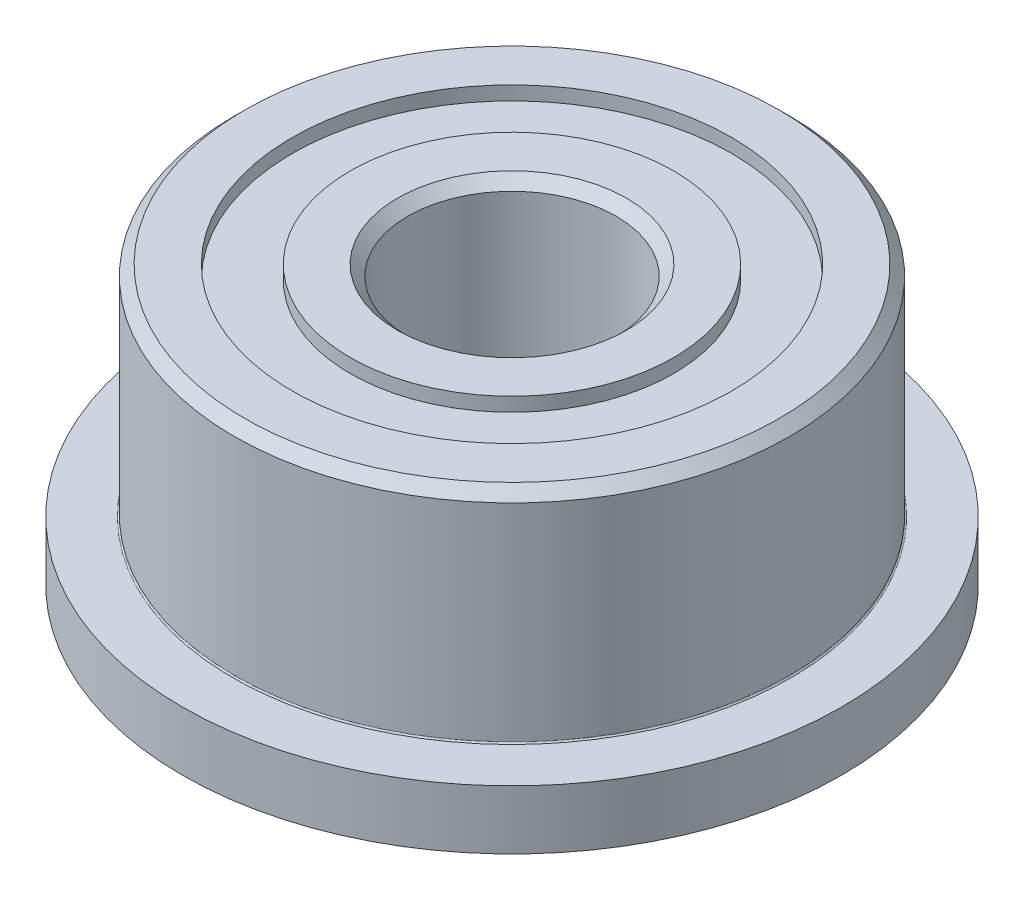
ISO-10303-21;
HEADER;
FILE_DESCRIPTION(('STEP AP214'),'2;1');
FILE_NAME('part.step','',(''),(''),'','','');
FILE_SCHEMA(('AUTOMOTIVE_DESIGN { 1 0 10303 214 1 1 1 1 }'));
ENDSEC;
DATA;
#1=APPLICATION_CONTEXT('core data for automotive mechanical design processes');
#2=APPLICATION_PROTOCOL_DEFINITION('international standard','automotive_design',2000,#1);
#3=PRODUCT_CONTEXT('',#1,'mechanical');
#4=PRODUCT('Part','Part','',(#3));
#5=PRODUCT_RELATED_PRODUCT_CATEGORY('part','',(#4));
#6=PRODUCT_DEFINITION_FORMATION('','',#4);
#7=PRODUCT_DEFINITION_CONTEXT('part definition',#1,'design');
#8=PRODUCT_DEFINITION('design','',#6,#7);
#9=PRODUCT_DEFINITION_SHAPE('','',#8);
#10=(LENGTH_UNIT() NAMED_UNIT(*) SI_UNIT(.MILLI.,.METRE.));
#11=(NAMED_UNIT(*) PLANE_ANGLE_UNIT() SI_UNIT($,.RADIAN.));
#12=(NAMED_UNIT(*) SI_UNIT($,.STERADIAN.) SOLID_ANGLE_UNIT());
#13=UNCERTAINTY_MEASURE_WITH_UNIT(LENGTH_MEASURE(1.E-05),#10,'distance_accuracy_value','');
#14=(GEOMETRIC_REPRESENTATION_CONTEXT(3) GLOBAL_UNCERTAINTY_ASSIGNED_CONTEXT((#13)) GLOBAL_UNIT_ASSIGNED_CONTEXT((#10,
#11,#12)) REPRESENTATION_CONTEXT('',''));
#15=CARTESIAN_POINT('',(0.,0.,0.));
#16=DIRECTION('',(0.,0.,1.));
#17=DIRECTION('',(1.,0.,0.));
#18=AXIS2_PLACEMENT_3D('',#15,#16,#17);
#19=CARTESIAN_POINT('',(-87.598115744829,3.1500000000191,50.574795705781));
#20=DIRECTION('',(0.,-1.,0.));
#21=DIRECTION('',(0.,0.,-1.));
#22=AXIS2_PLACEMENT_3D('',#19,#20,#21);
#23=CYLINDRICAL_SURFACE('',#22,2.32999999998933);
#24=CARTESIAN_POINT('',(-87.598115744829,-0.649999999953843,50.574795705781));
#25=DIRECTION('',(0.,-1.,0.));
#26=DIRECTION('',(0.,0.,-1.));
#27=AXIS2_PLACEMENT_3D('',#24,#25,#26);
#28=CIRCLE('',#27,2.32999999998933);
#29=CARTESIAN_POINT('',(-87.598115744829,-0.649999999953843,48.2447957057917));
#30=VERTEX_POINT('',#29);
#31=EDGE_CURVE('E10',#30,#30,#28,.T.);
#32=ORIENTED_EDGE('',*,*,#31,.T.);
#33=EDGE_LOOP('',(#32));
#34=FACE_BOUND('',#33,.T.);
#35=CARTESIAN_POINT('',(-87.598115744829,-0.849999999953843,50.574795705781));
#36=DIRECTION('',(0.,-1.,0.));
#37=DIRECTION('',(0.,0.,-1.));
#38=AXIS2_PLACEMENT_3D('',#35,#36,#37);
#39=CIRCLE('',#38,2.32999999998933);
#40=CARTESIAN_POINT('',(-87.598115744829,-0.849999999953843,48.2447957057917));
#41=VERTEX_POINT('',#40);
#42=EDGE_CURVE('E90',#41,#41,#39,.T.);
#43=ORIENTED_EDGE('',*,*,#42,.F.);
#44=EDGE_LOOP('',(#43));
#45=FACE_BOUND('',#44,.T.);
#46=ADVANCED_FACE('F32',(#34,#45),#23,.T.);
#47=CARTESIAN_POINT('',(-85.2681157448397,-0.649999999953843,50.574795705781));
#48=DIRECTION('',(0.,-1.,0.));
#49=DIRECTION('',(0.,0.,-1.));
#50=AXIS2_PLACEMENT_3D('',#47,#48,#49);
#51=PLANE('',#50);
#52=CARTESIAN_POINT('',(-87.598115744829,-0.649999999953843,50.574795705781));
#53=DIRECTION('',(0.,-1.,0.));
#54=DIRECTION('',(0.,0.,-1.));
#55=AXIS2_PLACEMENT_3D('',#52,#53,#54);
#56=CIRCLE('',#55,3.16499999998933);
#57=CARTESIAN_POINT('',(-87.598115744829,-0.649999999953843,47.4097957057917));
#58=VERTEX_POINT('',#57);
#59=EDGE_CURVE('E38',#58,#58,#56,.T.);
#60=ORIENTED_EDGE('',*,*,#59,.T.);
#61=EDGE_LOOP('',(#60));
#62=FACE_BOUND('',#61,.T.);
#63=ORIENTED_EDGE('',*,*,#31,.F.);
#64=EDGE_LOOP('',(#63));
#65=FACE_BOUND('',#64,.T.);
#66=ADVANCED_FACE('F121',(#62,#65),#51,.T.);
#67=CARTESIAN_POINT('',(-87.598115744829,3.1500000000191,50.574795705781));
#68=DIRECTION('',(0.,-1.,0.));
#69=DIRECTION('',(0.,0.,-1.));
#70=AXIS2_PLACEMENT_3D('',#67,#68,#69);
#71=CYLINDRICAL_SURFACE('',#70,3.16499999998933);
#72=CARTESIAN_POINT('',(-87.598115744829,-0.849999999953843,50.574795705781));
#73=DIRECTION('',(0.,-1.,0.));
#74=DIRECTION('',(0.,0.,-1.));
#75=AXIS2_PLACEMENT_3D('',#72,#73,#74);
#76=CIRCLE('',#75,3.16499999998933);
#77=CARTESIAN_POINT('',(-87.598115744829,-0.849999999953843,47.4097957057917));
#78=VERTEX_POINT('',#77);
#79=EDGE_CURVE('E42',#78,#78,#76,.T.);
#80=ORIENTED_EDGE('',*,*,#79,.T.);
#81=EDGE_LOOP('',(#80));
#82=FACE_BOUND('',#81,.T.);
#83=ORIENTED_EDGE('',*,*,#59,.F.);
#84=EDGE_LOOP('',(#83));
#85=FACE_BOUND('',#84,.T.);
#86=ADVANCED_FACE('F118',(#82,#85),#71,.F.);
#87=CARTESIAN_POINT('',(-84.4331157448397,-0.849999999953843,50.574795705781));
#88=DIRECTION('',(0.,-1.,0.));
#89=DIRECTION('',(0.,0.,-1.));
#90=AXIS2_PLACEMENT_3D('',#87,#88,#89);
#91=PLANE('',#90);
#92=CARTESIAN_POINT('',(-87.598115744829,-0.849999999953843,50.574795705781));
#93=DIRECTION('',(0.,-1.,0.));
#94=DIRECTION('',(0.,0.,-1.));
#95=AXIS2_PLACEMENT_3D('',#92,#93,#94);
#96=CIRCLE('',#95,4.74999999998933);
#97=CARTESIAN_POINT('',(-87.598115744829,-0.849999999953843,45.8247957057917));
#98=VERTEX_POINT('',#97);
#99=EDGE_CURVE('E46',#98,#98,#96,.T.);
#100=ORIENTED_EDGE('',*,*,#99,.T.);
#101=EDGE_LOOP('',(#100));
#102=FACE_BOUND('',#101,.T.);
#103=ORIENTED_EDGE('',*,*,#79,.F.);
#104=EDGE_LOOP('',(#103));
#105=FACE_BOUND('',#104,.T.);
#106=ADVANCED_FACE('F114',(#102,#105),#91,.T.);
#107=CARTESIAN_POINT('',(-87.598115744829,3.1500000000191,50.574795705781));
#108=DIRECTION('',(0.,-1.,0.));
#109=DIRECTION('',(0.,0.,-1.));
#110=AXIS2_PLACEMENT_3D('',#107,#108,#109);
#111=CYLINDRICAL_SURFACE('',#110,4.74999999998933);
#112=CARTESIAN_POINT('',(-87.598115744829,-4.72959345299007E-11,50.574795705781));
#113=DIRECTION('',(0.,-1.,0.));
#114=DIRECTION('',(0.,0.,-1.));
#115=AXIS2_PLACEMENT_3D('',#112,#113,#114);
#116=CIRCLE('',#115,4.74999999998933);
#117=CARTESIAN_POINT('',(-87.598115744829,-4.72959345299007E-11,45.8247957057917));
#118=VERTEX_POINT('',#117);
#119=EDGE_CURVE('E51',#118,#118,#116,.T.);
#120=ORIENTED_EDGE('',*,*,#119,.T.);
#121=EDGE_LOOP('',(#120));
#122=FACE_BOUND('',#121,.T.);
#123=ORIENTED_EDGE('',*,*,#99,.F.);
#124=EDGE_LOOP('',(#123));
#125=FACE_BOUND('',#124,.T.);
#126=ADVANCED_FACE('F110',(#122,#125),#111,.T.);
#127=CARTESIAN_POINT('',(-82.8481157448397,-4.72961303876495E-11,50.574795705781));
#128=DIRECTION('',(0.,1.,0.));
#129=DIRECTION('',(0.,0.,1.));
#130=AXIS2_PLACEMENT_3D('',#127,#128,#129);
#131=PLANE('',#130);
#132=CARTESIAN_POINT('',(-87.598115744829,-4.72963682107697E-11,50.574795705781));
#133=DIRECTION('',(0.,-1.,0.));
#134=DIRECTION('',(0.,0.,-1.));
#135=AXIS2_PLACEMENT_3D('',#132,#133,#134);
#136=CIRCLE('',#135,4.01999999996903);
#137=CARTESIAN_POINT('',(-87.598115744829,-4.72963682107697E-11,46.554795705812));
#138=VERTEX_POINT('',#137);
#139=EDGE_CURVE('E54',#138,#138,#136,.T.);
#140=ORIENTED_EDGE('',*,*,#139,.T.);
#141=EDGE_LOOP('',(#140));
#142=FACE_BOUND('',#141,.T.);
#143=ORIENTED_EDGE('',*,*,#119,.F.);
#144=EDGE_LOOP('',(#143));
#145=FACE_BOUND('',#144,.T.);
#146=ADVANCED_FACE('F105',(#142,#145),#131,.T.);
#147=CARTESIAN_POINT('',(-83.57811574486,-4.72961750872577E-11,50.574795705781));
#148=CARTESIAN_POINT('',(-83.57811574486,-0.0246367875809304,50.574795705781));
#149=CARTESIAN_POINT('',(-83.6227525323937,0.0199999999527029,50.574795705781));
#150=CARTESIAN_POINT('',(-83.59811574486,0.0199999999527038,50.574795705781));
#151=B_SPLINE_CURVE_WITH_KNOTS('',3,(#147,#148,#149,#150),.UNSPECIFIED.,.F.,.F.,(4,4),(0.,1.),.UNSPECIFIED.);
#152=CARTESIAN_POINT('',(-87.598115744829,3.1500000000191,50.574795705781));
#153=DIRECTION('',(0.,-1.,0.));
#154=AXIS1_PLACEMENT('',#152,#153);
#155=SURFACE_OF_REVOLUTION('',#151,#154);
#156=CARTESIAN_POINT('',(-87.598115744829,0.0199999999527037,50.574795705781));
#157=DIRECTION('',(0.,-1.,0.));
#158=DIRECTION('',(0.,0.,-1.));
#159=AXIS2_PLACEMENT_3D('',#156,#157,#158);
#160=CIRCLE('',#159,3.999999999969);
#161=CARTESIAN_POINT('',(-87.598115744829,0.0199999999527037,46.574795705812));
#162=VERTEX_POINT('',#161);
#163=EDGE_CURVE('E57',#162,#162,#160,.T.);
#164=ORIENTED_EDGE('',*,*,#163,.T.);
#165=EDGE_LOOP('',(#164));
#166=FACE_BOUND('',#165,.T.);
#167=ORIENTED_EDGE('',*,*,#139,.F.);
#168=EDGE_LOOP('',(#167));
#169=FACE_BOUND('',#168,.T.);
#170=ADVANCED_FACE('F100',(#166,#169),#155,.F.);
#171=CARTESIAN_POINT('',(-87.598115744829,3.1500000000191,50.574795705781));
#172=DIRECTION('',(0.,-1.,0.));
#173=DIRECTION('',(0.,0.,-1.));
#174=AXIS2_PLACEMENT_3D('',#171,#172,#173);
#175=CYLINDRICAL_SURFACE('',#174,3.999999999969);
#176=CARTESIAN_POINT('',(-87.598115744829,2.99999999997171,50.574795705781));
#177=DIRECTION('',(0.,-1.,0.));
#178=DIRECTION('',(0.,0.,-1.));
#179=AXIS2_PLACEMENT_3D('',#176,#177,#178);
#180=CIRCLE('',#179,3.999999999969);
#181=CARTESIAN_POINT('',(-87.598115744829,2.99999999997171,46.574795705812));
#182=VERTEX_POINT('',#181);
#183=EDGE_CURVE('E60',#182,#182,#180,.T.);
#184=ORIENTED_EDGE('',*,*,#183,.T.);
#185=EDGE_LOOP('',(#184));
#186=FACE_BOUND('',#185,.T.);
#187=ORIENTED_EDGE('',*,*,#163,.F.);
#188=EDGE_LOOP('',(#187));
#189=FACE_BOUND('',#188,.T.);
#190=ADVANCED_FACE('F104',(#186,#189),#175,.T.);
#191=CARTESIAN_POINT('',(-87.598115744829,2.99999999997171,50.574795705781));
#192=DIRECTION('',(0.,-1.,0.));
#193=DIRECTION('',(0.,0.,-1.));
#194=AXIS2_PLACEMENT_3D('',#191,#192,#193);
#195=CONICAL_SURFACE('',#194,3.999999999969,0.785398163397455);
#196=CARTESIAN_POINT('',(-87.598115744829,3.14999999999068,50.574795705781));
#197=DIRECTION('',(0.,-1.,0.));
#198=DIRECTION('',(0.,0.,-1.));
#199=AXIS2_PLACEMENT_3D('',#196,#197,#198);
#200=CIRCLE('',#199,3.84999999995003);
#201=CARTESIAN_POINT('',(-87.598115744829,3.14999999999068,46.724795705831));
#202=VERTEX_POINT('',#201);
#203=EDGE_CURVE('E63',#202,#202,#200,.T.);
#204=ORIENTED_EDGE('',*,*,#203,.T.);
#205=EDGE_LOOP('',(#204));
#206=FACE_BOUND('',#205,.T.);
#207=ORIENTED_EDGE('',*,*,#183,.F.);
#208=EDGE_LOOP('',(#207));
#209=FACE_BOUND('',#208,.T.);
#210=ADVANCED_FACE('F184',(#206,#209),#195,.T.);
#211=CARTESIAN_POINT('',(-83.748115744879,3.14999999999068,50.574795705781));
#212=DIRECTION('',(0.,1.,0.));
#213=DIRECTION('',(0.,0.,1.));
#214=AXIS2_PLACEMENT_3D('',#211,#212,#213);
#215=PLANE('',#214);
#216=CARTESIAN_POINT('',(-87.598115744829,3.14999999999068,50.574795705781));
#217=DIRECTION('',(0.,-1.,0.));
#218=DIRECTION('',(0.,0.,-1.));
#219=AXIS2_PLACEMENT_3D('',#216,#217,#218);
#220=CIRCLE('',#219,3.16499999998933);
#221=CARTESIAN_POINT('',(-87.598115744829,3.14999999999068,47.4097957057917));
#222=VERTEX_POINT('',#221);
#223=EDGE_CURVE('E66',#222,#222,#220,.T.);
#224=ORIENTED_EDGE('',*,*,#223,.T.);
#225=EDGE_LOOP('',(#224));
#226=FACE_BOUND('',#225,.T.);
#227=ORIENTED_EDGE('',*,*,#203,.F.);
#228=EDGE_LOOP('',(#227));
#229=FACE_BOUND('',#228,.T.);
#230=ADVANCED_FACE('F178',(#226,#229),#215,.T.);
#231=CARTESIAN_POINT('',(-87.598115744829,3.1500000000191,50.574795705781));
#232=DIRECTION('',(0.,-1.,0.));
#233=DIRECTION('',(0.,0.,-1.));
#234=AXIS2_PLACEMENT_3D('',#231,#232,#233);
#235=CYLINDRICAL_SURFACE('',#234,3.16499999998933);
#236=CARTESIAN_POINT('',(-87.598115744829,2.95000000004616,50.574795705781));
#237=DIRECTION('',(0.,-1.,0.));
#238=DIRECTION('',(0.,0.,-1.));
#239=AXIS2_PLACEMENT_3D('',#236,#237,#238);
#240=CIRCLE('',#239,3.16499999998933);
#241=CARTESIAN_POINT('',(-87.598115744829,2.95000000004616,47.4097957057917));
#242=VERTEX_POINT('',#241);
#243=EDGE_CURVE('E69',#242,#242,#240,.T.);
#244=ORIENTED_EDGE('',*,*,#243,.T.);
#245=EDGE_LOOP('',(#244));
#246=FACE_BOUND('',#245,.T.);
#247=ORIENTED_EDGE('',*,*,#223,.F.);
#248=EDGE_LOOP('',(#247));
#249=FACE_BOUND('',#248,.T.);
#250=ADVANCED_FACE('F172',(#246,#249),#235,.F.);
#251=CARTESIAN_POINT('',(-84.4331157448397,2.95000000004616,50.574795705781));
#252=DIRECTION('',(0.,1.,0.));
#253=DIRECTION('',(0.,0.,1.));
#254=AXIS2_PLACEMENT_3D('',#251,#252,#253);
#255=PLANE('',#254);
#256=CARTESIAN_POINT('',(-87.598115744829,2.95000000004616,50.574795705781));
#257=DIRECTION('',(0.,-1.,0.));
#258=DIRECTION('',(0.,0.,-1.));
#259=AXIS2_PLACEMENT_3D('',#256,#257,#258);
#260=CIRCLE('',#259,2.32999999998933);
#261=CARTESIAN_POINT('',(-87.598115744829,2.95000000004616,48.2447957057917));
#262=VERTEX_POINT('',#261);
#263=EDGE_CURVE('E72',#262,#262,#260,.T.);
#264=ORIENTED_EDGE('',*,*,#263,.T.);
#265=EDGE_LOOP('',(#264));
#266=FACE_BOUND('',#265,.T.);
#267=ORIENTED_EDGE('',*,*,#243,.F.);
#268=EDGE_LOOP('',(#267));
#269=FACE_BOUND('',#268,.T.);
#270=ADVANCED_FACE('F166',(#266,#269),#255,.T.);
#271=CARTESIAN_POINT('',(-87.598115744829,3.1500000000191,50.574795705781));
#272=DIRECTION('',(0.,-1.,0.));
#273=DIRECTION('',(0.,0.,-1.));
#274=AXIS2_PLACEMENT_3D('',#271,#272,#273);
#275=CYLINDRICAL_SURFACE('',#274,2.32999999998933);
#276=CARTESIAN_POINT('',(-87.598115744829,3.14999999999068,50.574795705781));
#277=DIRECTION('',(0.,-1.,0.));
#278=DIRECTION('',(0.,0.,-1.));
#279=AXIS2_PLACEMENT_3D('',#276,#277,#278);
#280=CIRCLE('',#279,2.32999999998933);
#281=CARTESIAN_POINT('',(-87.598115744829,3.14999999999068,48.2447957057917));
#282=VERTEX_POINT('',#281);
#283=EDGE_CURVE('E75',#282,#282,#280,.T.);
#284=ORIENTED_EDGE('',*,*,#283,.T.);
#285=EDGE_LOOP('',(#284));
#286=FACE_BOUND('',#285,.T.);
#287=ORIENTED_EDGE('',*,*,#263,.F.);
#288=EDGE_LOOP('',(#287));
#289=FACE_BOUND('',#288,.T.);
#290=ADVANCED_FACE('F160',(#286,#289),#275,.T.);
#291=CARTESIAN_POINT('',(-85.2681157448397,3.14999999999067,50.574795705781));
#292=DIRECTION('',(0.,1.,0.));
#293=DIRECTION('',(0.,0.,1.));
#294=AXIS2_PLACEMENT_3D('',#291,#292,#293);
#295=PLANE('',#294);
#296=CARTESIAN_POINT('',(-87.598115744829,3.14999999999067,50.574795705781));
#297=DIRECTION('',(0.,-1.,0.));
#298=DIRECTION('',(0.,0.,-1.));
#299=AXIS2_PLACEMENT_3D('',#296,#297,#298);
#300=CIRCLE('',#299,1.64999999999069);
#301=CARTESIAN_POINT('',(-87.598115744829,3.14999999999067,48.9247957057903));
#302=VERTEX_POINT('',#301);
#303=EDGE_CURVE('E78',#302,#302,#300,.T.);
#304=ORIENTED_EDGE('',*,*,#303,.T.);
#305=EDGE_LOOP('',(#304));
#306=FACE_BOUND('',#305,.T.);
#307=ORIENTED_EDGE('',*,*,#283,.F.);
#308=EDGE_LOOP('',(#307));
#309=FACE_BOUND('',#308,.T.);
#310=ADVANCED_FACE('F154',(#306,#309),#295,.T.);
#311=CARTESIAN_POINT('',(-87.598115744829,3.14999999999067,50.574795705781));
#312=DIRECTION('',(0.,1.,0.));
#313=DIRECTION('',(0.,0.,1.));
#314=AXIS2_PLACEMENT_3D('',#311,#312,#313);
#315=CONICAL_SURFACE('',#314,1.64999999999069,0.785398163397437);
#316=CARTESIAN_POINT('',(-87.598115744829,3.,50.574795705781));
#317=DIRECTION('',(0.,-1.,0.));
#318=DIRECTION('',(0.,0.,-1.));
#319=AXIS2_PLACEMENT_3D('',#316,#317,#318);
#320=CIRCLE('',#319,1.50000000000002);
#321=CARTESIAN_POINT('',(-87.598115744829,3.,49.074795705781));
#322=VERTEX_POINT('',#321);
#323=EDGE_CURVE('E81',#322,#322,#320,.T.);
#324=ORIENTED_EDGE('',*,*,#323,.T.);
#325=EDGE_LOOP('',(#324));
#326=FACE_BOUND('',#325,.T.);
#327=ORIENTED_EDGE('',*,*,#303,.F.);
#328=EDGE_LOOP('',(#327));
#329=FACE_BOUND('',#328,.T.);
#330=ADVANCED_FACE('F148',(#326,#329),#315,.F.);
#331=CARTESIAN_POINT('',(-87.598115744829,3.1500000000191,50.574795705781));
#332=DIRECTION('',(0.,-1.,0.));
#333=DIRECTION('',(0.,0.,-1.));
#334=AXIS2_PLACEMENT_3D('',#331,#332,#333);
#335=CYLINDRICAL_SURFACE('',#334,1.50000000000002);
#336=CARTESIAN_POINT('',(-87.598115744829,-0.699999999923966,50.574795705781));
#337=DIRECTION('',(0.,-1.,0.));
#338=DIRECTION('',(0.,0.,-1.));
#339=AXIS2_PLACEMENT_3D('',#336,#337,#338);
#340=CIRCLE('',#339,1.50000000000002);
#341=CARTESIAN_POINT('',(-87.598115744829,-0.699999999923966,49.074795705781));
#342=VERTEX_POINT('',#341);
#343=EDGE_CURVE('E84',#342,#342,#340,.T.);
#344=ORIENTED_EDGE('',*,*,#343,.T.);
#345=EDGE_LOOP('',(#344));
#346=FACE_BOUND('',#345,.T.);
#347=ORIENTED_EDGE('',*,*,#323,.F.);
#348=EDGE_LOOP('',(#347));
#349=FACE_BOUND('',#348,.T.);
#350=ADVANCED_FACE('F142',(#346,#349),#335,.F.);
#351=CARTESIAN_POINT('',(-87.598115744829,-0.699999999923966,50.574795705781));
#352=DIRECTION('',(0.,-1.,0.));
#353=DIRECTION('',(0.,0.,-1.));
#354=AXIS2_PLACEMENT_3D('',#351,#352,#353);
#355=CONICAL_SURFACE('',#354,1.50000000000002,0.785398163397445);
#356=CARTESIAN_POINT('',(-87.598115744829,-0.849999999953843,50.574795705781));
#357=DIRECTION('',(0.,-1.,0.));
#358=DIRECTION('',(0.,0.,-1.));
#359=AXIS2_PLACEMENT_3D('',#356,#357,#358);
#360=CIRCLE('',#359,1.65000000002989);
#361=CARTESIAN_POINT('',(-87.598115744829,-0.849999999953843,48.9247957057511));
#362=VERTEX_POINT('',#361);
#363=EDGE_CURVE('E87',#362,#362,#360,.T.);
#364=ORIENTED_EDGE('',*,*,#363,.T.);
#365=EDGE_LOOP('',(#364));
#366=FACE_BOUND('',#365,.T.);
#367=ORIENTED_EDGE('',*,*,#343,.F.);
#368=EDGE_LOOP('',(#367));
#369=FACE_BOUND('',#368,.T.);
#370=ADVANCED_FACE('F136',(#366,#369),#355,.F.);
#371=CARTESIAN_POINT('',(-85.9481157447991,-0.849999999953843,50.574795705781));
#372=DIRECTION('',(0.,-1.,0.));
#373=DIRECTION('',(0.,0.,-1.));
#374=AXIS2_PLACEMENT_3D('',#371,#372,#373);
#375=PLANE('',#374);
#376=ORIENTED_EDGE('',*,*,#42,.T.);
#377=EDGE_LOOP('',(#376));
#378=FACE_BOUND('',#377,.T.);
#379=ORIENTED_EDGE('',*,*,#363,.F.);
#380=EDGE_LOOP('',(#379));
#381=FACE_BOUND('',#380,.T.);
#382=ADVANCED_FACE('F133',(#378,#381),#375,.T.);
#383=CLOSED_SHELL('',(#46,#66,#86,#106,#126,#146,#170,#190,#210,#230,#250,#270,#290,#310,#330,
#350,#370,#382));
#384=MANIFOLD_SOLID_BREP('B2',#383);
#385=ADVANCED_BREP_SHAPE_REPRESENTATION('',(#18,#384),#14);
#386=SHAPE_DEFINITION_REPRESENTATION(#9,#385);
ENDSEC;
END-ISO-10303-21;
